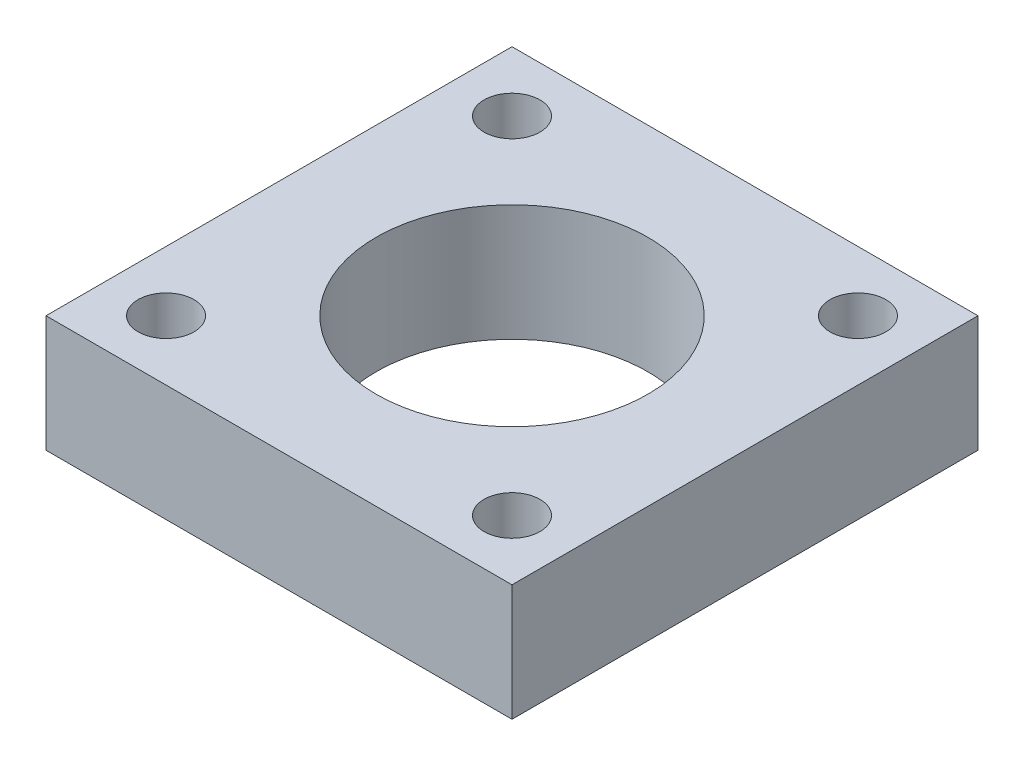
ISO-10303-21;
HEADER;
FILE_DESCRIPTION(('STEP AP214'),'2;1');
FILE_NAME('part.step','',(''),(''),'','','');
FILE_SCHEMA(('AUTOMOTIVE_DESIGN { 1 0 10303 214 1 1 1 1 }'));
ENDSEC;
DATA;
#1=APPLICATION_CONTEXT('core data for automotive mechanical design processes');
#2=APPLICATION_PROTOCOL_DEFINITION('international standard','automotive_design',2000,#1);
#3=PRODUCT_CONTEXT('',#1,'mechanical');
#4=PRODUCT('Part','Part','',(#3));
#5=PRODUCT_RELATED_PRODUCT_CATEGORY('part','',(#4));
#6=PRODUCT_DEFINITION_FORMATION('','',#4);
#7=PRODUCT_DEFINITION_CONTEXT('part definition',#1,'design');
#8=PRODUCT_DEFINITION('design','',#6,#7);
#9=PRODUCT_DEFINITION_SHAPE('','',#8);
#10=(LENGTH_UNIT() NAMED_UNIT(*) SI_UNIT(.MILLI.,.METRE.));
#11=(NAMED_UNIT(*) PLANE_ANGLE_UNIT() SI_UNIT($,.RADIAN.));
#12=(NAMED_UNIT(*) SI_UNIT($,.STERADIAN.) SOLID_ANGLE_UNIT());
#13=UNCERTAINTY_MEASURE_WITH_UNIT(LENGTH_MEASURE(1.E-05),#10,'distance_accuracy_value','');
#14=(GEOMETRIC_REPRESENTATION_CONTEXT(3) GLOBAL_UNCERTAINTY_ASSIGNED_CONTEXT((#13)) GLOBAL_UNIT_ASSIGNED_CONTEXT((#10,
#11,#12)) REPRESENTATION_CONTEXT('',''));
#15=CARTESIAN_POINT('',(0.,0.,0.));
#16=DIRECTION('',(0.,0.,1.));
#17=DIRECTION('',(1.,0.,0.));
#18=AXIS2_PLACEMENT_3D('',#15,#16,#17);
#19=CARTESIAN_POINT('',(0.,9.525,0.));
#20=DIRECTION('',(0.,-1.,0.));
#21=DIRECTION('',(0.,0.,-1.));
#22=AXIS2_PLACEMENT_3D('',#19,#20,#21);
#23=PLANE('',#22);
#24=DIRECTION('',(0.,0.,-1.));
#25=VECTOR('',#24,1.);
#26=CARTESIAN_POINT('',(19.05,9.525,19.05));
#27=LINE('',#26,#25);
#28=CARTESIAN_POINT('',(19.05,9.525,19.05));
#29=VERTEX_POINT('',#28);
#30=CARTESIAN_POINT('',(19.05,9.525,-19.05));
#31=VERTEX_POINT('',#30);
#32=EDGE_CURVE('E85',#29,#31,#27,.T.);
#33=ORIENTED_EDGE('',*,*,#32,.T.);
#34=DIRECTION('',(-1.,0.,0.));
#35=VECTOR('',#34,1.);
#36=CARTESIAN_POINT('',(-19.05,9.525,-19.05));
#37=LINE('',#36,#35);
#38=CARTESIAN_POINT('',(-19.05,9.525,-19.05));
#39=VERTEX_POINT('',#38);
#40=EDGE_CURVE('E80',#31,#39,#37,.T.);
#41=ORIENTED_EDGE('',*,*,#40,.T.);
#42=DIRECTION('',(0.,0.,1.));
#43=VECTOR('',#42,1.);
#44=CARTESIAN_POINT('',(-19.05,9.525,19.05));
#45=LINE('',#44,#43);
#46=CARTESIAN_POINT('',(-19.05,9.525,19.05));
#47=VERTEX_POINT('',#46);
#48=EDGE_CURVE('E83',#39,#47,#45,.T.);
#49=ORIENTED_EDGE('',*,*,#48,.T.);
#50=DIRECTION('',(1.,0.,0.));
#51=VECTOR('',#50,1.);
#52=CARTESIAN_POINT('',(-19.05,9.525,19.05));
#53=LINE('',#52,#51);
#54=EDGE_CURVE('E50',#47,#29,#53,.T.);
#55=ORIENTED_EDGE('',*,*,#54,.T.);
#56=EDGE_LOOP('',(#33,#41,#49,#55));
#57=FACE_BOUND('',#56,.T.);
#58=CARTESIAN_POINT('',(14.142135623731,9.525,-14.1421356237309));
#59=DIRECTION('',(0.,1.,0.));
#60=DIRECTION('',(0.,0.,1.));
#61=AXIS2_PLACEMENT_3D('',#58,#59,#60);
#62=CIRCLE('',#61,2.286);
#63=CARTESIAN_POINT('',(14.142135623731,9.525,-11.8561356237309));
#64=VERTEX_POINT('',#63);
#65=EDGE_CURVE('E100',#64,#64,#62,.T.);
#66=ORIENTED_EDGE('',*,*,#65,.F.);
#67=EDGE_LOOP('',(#66));
#68=FACE_BOUND('',#67,.T.);
#69=CARTESIAN_POINT('',(0.,9.525,0.));
#70=DIRECTION('',(0.,1.,0.));
#71=DIRECTION('',(0.,0.,1.));
#72=AXIS2_PLACEMENT_3D('',#69,#70,#71);
#73=CIRCLE('',#72,11.1125);
#74=CARTESIAN_POINT('',(0.,9.525,11.1125));
#75=VERTEX_POINT('',#74);
#76=EDGE_CURVE('E115',#75,#75,#73,.T.);
#77=ORIENTED_EDGE('',*,*,#76,.F.);
#78=EDGE_LOOP('',(#77));
#79=FACE_BOUND('',#78,.T.);
#80=CARTESIAN_POINT('',(14.1421356237309,9.525,14.1421356237309));
#81=DIRECTION('',(0.,1.,0.));
#82=DIRECTION('',(0.,0.,1.));
#83=AXIS2_PLACEMENT_3D('',#80,#81,#82);
#84=CIRCLE('',#83,2.286);
#85=CARTESIAN_POINT('',(14.1421356237309,9.525,16.4281356237309));
#86=VERTEX_POINT('',#85);
#87=EDGE_CURVE('E121',#86,#86,#84,.T.);
#88=ORIENTED_EDGE('',*,*,#87,.F.);
#89=EDGE_LOOP('',(#88));
#90=FACE_BOUND('',#89,.T.);
#91=CARTESIAN_POINT('',(-14.142135623731,9.525,14.1421356237309));
#92=DIRECTION('',(0.,1.,0.));
#93=DIRECTION('',(0.,0.,1.));
#94=AXIS2_PLACEMENT_3D('',#91,#92,#93);
#95=CIRCLE('',#94,2.286);
#96=CARTESIAN_POINT('',(-14.142135623731,9.525,16.4281356237309));
#97=VERTEX_POINT('',#96);
#98=EDGE_CURVE('E127',#97,#97,#95,.T.);
#99=ORIENTED_EDGE('',*,*,#98,.F.);
#100=EDGE_LOOP('',(#99));
#101=FACE_BOUND('',#100,.T.);
#102=CARTESIAN_POINT('',(-14.142135623731,9.525,-14.1421356237309));
#103=DIRECTION('',(0.,1.,0.));
#104=DIRECTION('',(0.,0.,1.));
#105=AXIS2_PLACEMENT_3D('',#102,#103,#104);
#106=CIRCLE('',#105,2.286);
#107=CARTESIAN_POINT('',(-14.142135623731,9.525,-11.8561356237309));
#108=VERTEX_POINT('',#107);
#109=EDGE_CURVE('E133',#108,#108,#106,.T.);
#110=ORIENTED_EDGE('',*,*,#109,.F.);
#111=EDGE_LOOP('',(#110));
#112=FACE_BOUND('',#111,.T.);
#113=ADVANCED_FACE('F33',(#57,#68,#79,#90,#101,#112),#23,.F.);
#114=CARTESIAN_POINT('',(0.,0.,0.));
#115=DIRECTION('',(0.,-1.,0.));
#116=DIRECTION('',(0.,0.,-1.));
#117=AXIS2_PLACEMENT_3D('',#114,#115,#116);
#118=PLANE('',#117);
#119=CARTESIAN_POINT('',(-14.142135623731,0.,14.1421356237309));
#120=DIRECTION('',(0.,1.,0.));
#121=DIRECTION('',(0.,0.,1.));
#122=AXIS2_PLACEMENT_3D('',#119,#120,#121);
#123=CIRCLE('',#122,2.286);
#124=CARTESIAN_POINT('',(-14.142135623731,0.,16.4281356237309));
#125=VERTEX_POINT('',#124);
#126=EDGE_CURVE('E130',#125,#125,#123,.T.);
#127=ORIENTED_EDGE('',*,*,#126,.T.);
#128=EDGE_LOOP('',(#127));
#129=FACE_BOUND('',#128,.T.);
#130=CARTESIAN_POINT('',(0.,0.,0.));
#131=DIRECTION('',(0.,1.,0.));
#132=DIRECTION('',(0.,0.,1.));
#133=AXIS2_PLACEMENT_3D('',#130,#131,#132);
#134=CIRCLE('',#133,11.1125);
#135=CARTESIAN_POINT('',(0.,0.,11.1125));
#136=VERTEX_POINT('',#135);
#137=EDGE_CURVE('E118',#136,#136,#134,.T.);
#138=ORIENTED_EDGE('',*,*,#137,.T.);
#139=EDGE_LOOP('',(#138));
#140=FACE_BOUND('',#139,.T.);
#141=DIRECTION('',(0.,0.,-1.));
#142=VECTOR('',#141,1.);
#143=CARTESIAN_POINT('',(19.05,0.,19.05));
#144=LINE('',#143,#142);
#145=CARTESIAN_POINT('',(19.05,0.,19.05));
#146=VERTEX_POINT('',#145);
#147=CARTESIAN_POINT('',(19.05,0.,-19.05));
#148=VERTEX_POINT('',#147);
#149=EDGE_CURVE('E97',#146,#148,#144,.T.);
#150=ORIENTED_EDGE('',*,*,#149,.F.);
#151=DIRECTION('',(1.,0.,0.));
#152=VECTOR('',#151,1.);
#153=CARTESIAN_POINT('',(-19.05,0.,19.05));
#154=LINE('',#153,#152);
#155=CARTESIAN_POINT('',(-19.05,0.,19.05));
#156=VERTEX_POINT('',#155);
#157=EDGE_CURVE('E73',#156,#146,#154,.T.);
#158=ORIENTED_EDGE('',*,*,#157,.F.);
#159=DIRECTION('',(0.,0.,1.));
#160=VECTOR('',#159,1.);
#161=CARTESIAN_POINT('',(-19.05,0.,19.05));
#162=LINE('',#161,#160);
#163=CARTESIAN_POINT('',(-19.05,0.,-19.05));
#164=VERTEX_POINT('',#163);
#165=EDGE_CURVE('E67',#164,#156,#162,.T.);
#166=ORIENTED_EDGE('',*,*,#165,.F.);
#167=DIRECTION('',(-1.,0.,0.));
#168=VECTOR('',#167,1.);
#169=CARTESIAN_POINT('',(-19.05,0.,-19.05));
#170=LINE('',#169,#168);
#171=EDGE_CURVE('E89',#148,#164,#170,.T.);
#172=ORIENTED_EDGE('',*,*,#171,.F.);
#173=EDGE_LOOP('',(#150,#158,#166,#172));
#174=FACE_BOUND('',#173,.T.);
#175=CARTESIAN_POINT('',(14.142135623731,0.,-14.1421356237309));
#176=DIRECTION('',(0.,1.,0.));
#177=DIRECTION('',(0.,0.,1.));
#178=AXIS2_PLACEMENT_3D('',#175,#176,#177);
#179=CIRCLE('',#178,2.286);
#180=CARTESIAN_POINT('',(14.142135623731,0.,-11.8561356237309));
#181=VERTEX_POINT('',#180);
#182=EDGE_CURVE('E112',#181,#181,#179,.T.);
#183=ORIENTED_EDGE('',*,*,#182,.T.);
#184=EDGE_LOOP('',(#183));
#185=FACE_BOUND('',#184,.T.);
#186=CARTESIAN_POINT('',(14.1421356237309,0.,14.1421356237309));
#187=DIRECTION('',(0.,1.,0.));
#188=DIRECTION('',(0.,0.,1.));
#189=AXIS2_PLACEMENT_3D('',#186,#187,#188);
#190=CIRCLE('',#189,2.286);
#191=CARTESIAN_POINT('',(14.1421356237309,0.,16.4281356237309));
#192=VERTEX_POINT('',#191);
#193=EDGE_CURVE('E124',#192,#192,#190,.T.);
#194=ORIENTED_EDGE('',*,*,#193,.T.);
#195=EDGE_LOOP('',(#194));
#196=FACE_BOUND('',#195,.T.);
#197=CARTESIAN_POINT('',(-14.142135623731,0.,-14.1421356237309));
#198=DIRECTION('',(0.,1.,0.));
#199=DIRECTION('',(0.,0.,1.));
#200=AXIS2_PLACEMENT_3D('',#197,#198,#199);
#201=CIRCLE('',#200,2.286);
#202=CARTESIAN_POINT('',(-14.142135623731,0.,-11.8561356237309));
#203=VERTEX_POINT('',#202);
#204=EDGE_CURVE('E136',#203,#203,#201,.T.);
#205=ORIENTED_EDGE('',*,*,#204,.T.);
#206=EDGE_LOOP('',(#205));
#207=FACE_BOUND('',#206,.T.);
#208=ADVANCED_FACE('F108',(#129,#140,#174,#185,#196,#207),#118,.T.);
#209=CARTESIAN_POINT('',(19.05,9.525,19.05));
#210=DIRECTION('',(-1.,0.,0.));
#211=DIRECTION('',(0.,0.,1.));
#212=AXIS2_PLACEMENT_3D('',#209,#210,#211);
#213=PLANE('',#212);
#214=ORIENTED_EDGE('',*,*,#149,.T.);
#215=DIRECTION('',(0.,-1.,0.));
#216=VECTOR('',#215,1.);
#217=CARTESIAN_POINT('',(19.05,9.525,-19.05));
#218=LINE('',#217,#216);
#219=EDGE_CURVE('E11',#31,#148,#218,.T.);
#220=ORIENTED_EDGE('',*,*,#219,.F.);
#221=ORIENTED_EDGE('',*,*,#32,.F.);
#222=DIRECTION('',(0.,-1.,0.));
#223=VECTOR('',#222,1.);
#224=CARTESIAN_POINT('',(19.05,9.525,19.05));
#225=LINE('',#224,#223);
#226=EDGE_CURVE('E93',#29,#146,#225,.T.);
#227=ORIENTED_EDGE('',*,*,#226,.T.);
#228=EDGE_LOOP('',(#214,#220,#221,#227));
#229=FACE_BOUND('',#228,.T.);
#230=ADVANCED_FACE('F35',(#229),#213,.F.);
#231=CARTESIAN_POINT('',(-19.05,9.525,-19.05));
#232=DIRECTION('',(0.,0.,1.));
#233=DIRECTION('',(1.,0.,0.));
#234=AXIS2_PLACEMENT_3D('',#231,#232,#233);
#235=PLANE('',#234);
#236=ORIENTED_EDGE('',*,*,#171,.T.);
#237=DIRECTION('',(0.,-1.,0.));
#238=VECTOR('',#237,1.);
#239=CARTESIAN_POINT('',(-19.05,9.525,-19.05));
#240=LINE('',#239,#238);
#241=EDGE_CURVE('E42',#39,#164,#240,.T.);
#242=ORIENTED_EDGE('',*,*,#241,.F.);
#243=ORIENTED_EDGE('',*,*,#40,.F.);
#244=ORIENTED_EDGE('',*,*,#219,.T.);
#245=EDGE_LOOP('',(#236,#242,#243,#244));
#246=FACE_BOUND('',#245,.T.);
#247=ADVANCED_FACE('F88',(#246),#235,.F.);
#248=CARTESIAN_POINT('',(-19.05,9.525,19.05));
#249=DIRECTION('',(1.,0.,0.));
#250=DIRECTION('',(0.,0.,-1.));
#251=AXIS2_PLACEMENT_3D('',#248,#249,#250);
#252=PLANE('',#251);
#253=ORIENTED_EDGE('',*,*,#165,.T.);
#254=DIRECTION('',(0.,-1.,0.));
#255=VECTOR('',#254,1.);
#256=CARTESIAN_POINT('',(-19.05,9.525,19.05));
#257=LINE('',#256,#255);
#258=EDGE_CURVE('E90',#47,#156,#257,.T.);
#259=ORIENTED_EDGE('',*,*,#258,.F.);
#260=ORIENTED_EDGE('',*,*,#48,.F.);
#261=ORIENTED_EDGE('',*,*,#241,.T.);
#262=EDGE_LOOP('',(#253,#259,#260,#261));
#263=FACE_BOUND('',#262,.T.);
#264=ADVANCED_FACE('F91',(#263),#252,.F.);
#265=CARTESIAN_POINT('',(-19.05,9.525,19.05));
#266=DIRECTION('',(0.,0.,-1.));
#267=DIRECTION('',(-1.,0.,0.));
#268=AXIS2_PLACEMENT_3D('',#265,#266,#267);
#269=PLANE('',#268);
#270=ORIENTED_EDGE('',*,*,#157,.T.);
#271=ORIENTED_EDGE('',*,*,#226,.F.);
#272=ORIENTED_EDGE('',*,*,#54,.F.);
#273=ORIENTED_EDGE('',*,*,#258,.T.);
#274=EDGE_LOOP('',(#270,#271,#272,#273));
#275=FACE_BOUND('',#274,.T.);
#276=ADVANCED_FACE('F105',(#275),#269,.F.);
#277=CARTESIAN_POINT('',(14.142135623731,9.525,-14.1421356237309));
#278=DIRECTION('',(0.,-1.,0.));
#279=DIRECTION('',(0.,0.,-1.));
#280=AXIS2_PLACEMENT_3D('',#277,#278,#279);
#281=CYLINDRICAL_SURFACE('',#280,2.286);
#282=ORIENTED_EDGE('',*,*,#65,.T.);
#283=EDGE_LOOP('',(#282));
#284=FACE_BOUND('',#283,.T.);
#285=ORIENTED_EDGE('',*,*,#182,.F.);
#286=EDGE_LOOP('',(#285));
#287=FACE_BOUND('',#286,.T.);
#288=ADVANCED_FACE('F153',(#284,#287),#281,.F.);
#289=CARTESIAN_POINT('',(0.,9.525,0.));
#290=DIRECTION('',(0.,-1.,0.));
#291=DIRECTION('',(0.,0.,-1.));
#292=AXIS2_PLACEMENT_3D('',#289,#290,#291);
#293=CYLINDRICAL_SURFACE('',#292,11.1125);
#294=ORIENTED_EDGE('',*,*,#76,.T.);
#295=EDGE_LOOP('',(#294));
#296=FACE_BOUND('',#295,.T.);
#297=ORIENTED_EDGE('',*,*,#137,.F.);
#298=EDGE_LOOP('',(#297));
#299=FACE_BOUND('',#298,.T.);
#300=ADVANCED_FACE('F199',(#296,#299),#293,.F.);
#301=CARTESIAN_POINT('',(14.1421356237309,9.525,14.1421356237309));
#302=DIRECTION('',(0.,-1.,0.));
#303=DIRECTION('',(0.,0.,-1.));
#304=AXIS2_PLACEMENT_3D('',#301,#302,#303);
#305=CYLINDRICAL_SURFACE('',#304,2.286);
#306=ORIENTED_EDGE('',*,*,#87,.T.);
#307=EDGE_LOOP('',(#306));
#308=FACE_BOUND('',#307,.T.);
#309=ORIENTED_EDGE('',*,*,#193,.F.);
#310=EDGE_LOOP('',(#309));
#311=FACE_BOUND('',#310,.T.);
#312=ADVANCED_FACE('F207',(#308,#311),#305,.F.);
#313=CARTESIAN_POINT('',(-14.142135623731,9.525,14.1421356237309));
#314=DIRECTION('',(0.,-1.,0.));
#315=DIRECTION('',(0.,0.,-1.));
#316=AXIS2_PLACEMENT_3D('',#313,#314,#315);
#317=CYLINDRICAL_SURFACE('',#316,2.286);
#318=ORIENTED_EDGE('',*,*,#98,.T.);
#319=EDGE_LOOP('',(#318));
#320=FACE_BOUND('',#319,.T.);
#321=ORIENTED_EDGE('',*,*,#126,.F.);
#322=EDGE_LOOP('',(#321));
#323=FACE_BOUND('',#322,.T.);
#324=ADVANCED_FACE('F215',(#320,#323),#317,.F.);
#325=CARTESIAN_POINT('',(-14.142135623731,9.525,-14.1421356237309));
#326=DIRECTION('',(0.,-1.,0.));
#327=DIRECTION('',(0.,0.,-1.));
#328=AXIS2_PLACEMENT_3D('',#325,#326,#327);
#329=CYLINDRICAL_SURFACE('',#328,2.286);
#330=ORIENTED_EDGE('',*,*,#109,.T.);
#331=EDGE_LOOP('',(#330));
#332=FACE_BOUND('',#331,.T.);
#333=ORIENTED_EDGE('',*,*,#204,.F.);
#334=EDGE_LOOP('',(#333));
#335=FACE_BOUND('',#334,.T.);
#336=ADVANCED_FACE('F142',(#332,#335),#329,.F.);
#337=CLOSED_SHELL('',(#113,#208,#230,#247,#264,#276,#288,#300,#312,#324,#336));
#338=MANIFOLD_SOLID_BREP('B2',#337);
#339=ADVANCED_BREP_SHAPE_REPRESENTATION('',(#18,#338),#14);
#340=SHAPE_DEFINITION_REPRESENTATION(#9,#339);
ENDSEC;
END-ISO-10303-21;
